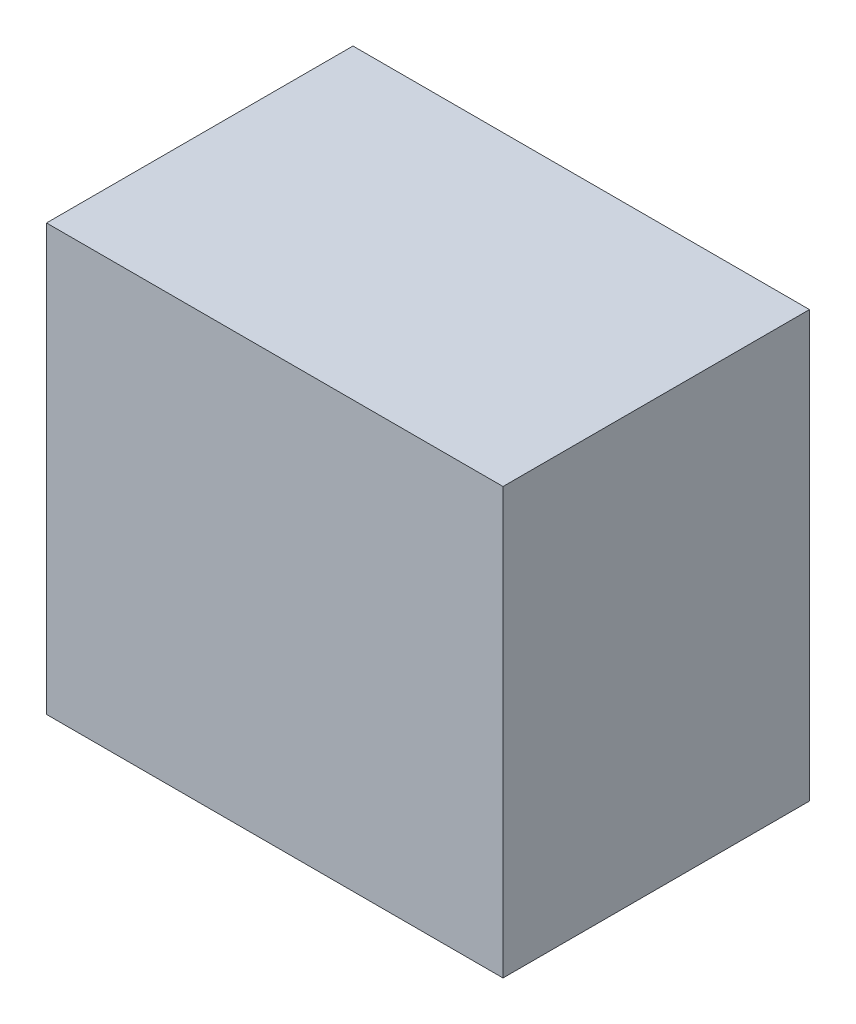
ISO-10303-21;
HEADER;
FILE_DESCRIPTION(('STEP AP214'),'2;1');
FILE_NAME('part.step','',(''),(''),'','','');
FILE_SCHEMA(('AUTOMOTIVE_DESIGN { 1 0 10303 214 1 1 1 1 }'));
ENDSEC;
DATA;
#1=APPLICATION_CONTEXT('core data for automotive mechanical design processes');
#2=APPLICATION_PROTOCOL_DEFINITION('international standard','automotive_design',2000,#1);
#3=PRODUCT_CONTEXT('',#1,'mechanical');
#4=PRODUCT('Part','Part','',(#3));
#5=PRODUCT_RELATED_PRODUCT_CATEGORY('part','',(#4));
#6=PRODUCT_DEFINITION_FORMATION('','',#4);
#7=PRODUCT_DEFINITION_CONTEXT('part definition',#1,'design');
#8=PRODUCT_DEFINITION('design','',#6,#7);
#9=PRODUCT_DEFINITION_SHAPE('','',#8);
#10=(LENGTH_UNIT() NAMED_UNIT(*) SI_UNIT(.MILLI.,.METRE.));
#11=(NAMED_UNIT(*) PLANE_ANGLE_UNIT() SI_UNIT($,.RADIAN.));
#12=(NAMED_UNIT(*) SI_UNIT($,.STERADIAN.) SOLID_ANGLE_UNIT());
#13=UNCERTAINTY_MEASURE_WITH_UNIT(LENGTH_MEASURE(1.E-05),#10,'distance_accuracy_value','');
#14=(GEOMETRIC_REPRESENTATION_CONTEXT(3) GLOBAL_UNCERTAINTY_ASSIGNED_CONTEXT((#13)) GLOBAL_UNIT_ASSIGNED_CONTEXT((#10,
#11,#12)) REPRESENTATION_CONTEXT('',''));
#15=CARTESIAN_POINT('',(0.,0.,0.));
#16=DIRECTION('',(0.,0.,1.));
#17=DIRECTION('',(1.,0.,0.));
#18=AXIS2_PLACEMENT_3D('',#15,#16,#17);
#19=CARTESIAN_POINT('',(-30.1907358786566,22.6807861745121,28.8));
#20=DIRECTION('',(1.,0.,0.));
#21=DIRECTION('',(0.,1.,0.));
#22=AXIS2_PLACEMENT_3D('',#19,#20,#21);
#23=PLANE('',#22);
#24=DIRECTION('',(0.,-1.,0.));
#25=VECTOR('',#24,1.);
#26=CARTESIAN_POINT('',(-30.1907358786566,22.6807861745121,0.));
#27=LINE('',#26,#25);
#28=CARTESIAN_POINT('',(-30.1907358786566,22.6807861745121,0.));
#29=VERTEX_POINT('',#28);
#30=CARTESIAN_POINT('',(-30.1907358786566,-17.3192138254879,0.));
#31=VERTEX_POINT('',#30);
#32=EDGE_CURVE('E102',#29,#31,#27,.T.);
#33=ORIENTED_EDGE('',*,*,#32,.T.);
#34=DIRECTION('',(0.,0.,-1.));
#35=VECTOR('',#34,1.);
#36=CARTESIAN_POINT('',(-30.1907358786566,-17.3192138254879,28.8));
#37=LINE('',#36,#35);
#38=CARTESIAN_POINT('',(-30.1907358786566,-17.3192138254879,28.8));
#39=VERTEX_POINT('',#38);
#40=EDGE_CURVE('E11',#39,#31,#37,.T.);
#41=ORIENTED_EDGE('',*,*,#40,.F.);
#42=DIRECTION('',(0.,-1.,0.));
#43=VECTOR('',#42,1.);
#44=CARTESIAN_POINT('',(-30.1907358786566,22.6807861745121,28.8));
#45=LINE('',#44,#43);
#46=CARTESIAN_POINT('',(-30.1907358786566,22.6807861745121,28.8));
#47=VERTEX_POINT('',#46);
#48=EDGE_CURVE('E90',#47,#39,#45,.T.);
#49=ORIENTED_EDGE('',*,*,#48,.F.);
#50=DIRECTION('',(0.,0.,-1.));
#51=VECTOR('',#50,1.);
#52=CARTESIAN_POINT('',(-30.1907358786566,22.6807861745121,28.8));
#53=LINE('',#52,#51);
#54=EDGE_CURVE('E98',#47,#29,#53,.T.);
#55=ORIENTED_EDGE('',*,*,#54,.T.);
#56=EDGE_LOOP('',(#33,#41,#49,#55));
#57=FACE_BOUND('',#56,.T.);
#58=ADVANCED_FACE('F39',(#57),#23,.F.);
#59=CARTESIAN_POINT('',(-30.1907358786566,-17.3192138254879,28.8));
#60=DIRECTION('',(0.,1.,0.));
#61=DIRECTION('',(0.,0.,1.));
#62=AXIS2_PLACEMENT_3D('',#59,#60,#61);
#63=PLANE('',#62);
#64=DIRECTION('',(1.,0.,0.));
#65=VECTOR('',#64,1.);
#66=CARTESIAN_POINT('',(-30.1907358786566,-17.3192138254879,0.));
#67=LINE('',#66,#65);
#68=CARTESIAN_POINT('',(12.7092641213434,-17.3192138254879,0.));
#69=VERTEX_POINT('',#68);
#70=EDGE_CURVE('E94',#31,#69,#67,.T.);
#71=ORIENTED_EDGE('',*,*,#70,.T.);
#72=DIRECTION('',(0.,0.,-1.));
#73=VECTOR('',#72,1.);
#74=CARTESIAN_POINT('',(12.7092641213434,-17.3192138254879,28.8));
#75=LINE('',#74,#73);
#76=CARTESIAN_POINT('',(12.7092641213434,-17.3192138254879,28.8));
#77=VERTEX_POINT('',#76);
#78=EDGE_CURVE('E47',#77,#69,#75,.T.);
#79=ORIENTED_EDGE('',*,*,#78,.F.);
#80=DIRECTION('',(1.,0.,0.));
#81=VECTOR('',#80,1.);
#82=CARTESIAN_POINT('',(-30.1907358786566,-17.3192138254879,28.8));
#83=LINE('',#82,#81);
#84=EDGE_CURVE('E85',#39,#77,#83,.T.);
#85=ORIENTED_EDGE('',*,*,#84,.F.);
#86=ORIENTED_EDGE('',*,*,#40,.T.);
#87=EDGE_LOOP('',(#71,#79,#85,#86));
#88=FACE_BOUND('',#87,.T.);
#89=ADVANCED_FACE('F93',(#88),#63,.F.);
#90=CARTESIAN_POINT('',(12.7092641213434,22.6807861745121,28.8));
#91=DIRECTION('',(-1.,0.,0.));
#92=DIRECTION('',(0.,-1.,0.));
#93=AXIS2_PLACEMENT_3D('',#90,#91,#92);
#94=PLANE('',#93);
#95=DIRECTION('',(0.,1.,0.));
#96=VECTOR('',#95,1.);
#97=CARTESIAN_POINT('',(12.7092641213434,22.6807861745121,0.));
#98=LINE('',#97,#96);
#99=CARTESIAN_POINT('',(12.7092641213434,22.6807861745121,0.));
#100=VERTEX_POINT('',#99);
#101=EDGE_CURVE('E72',#69,#100,#98,.T.);
#102=ORIENTED_EDGE('',*,*,#101,.T.);
#103=DIRECTION('',(0.,0.,-1.));
#104=VECTOR('',#103,1.);
#105=CARTESIAN_POINT('',(12.7092641213434,22.6807861745121,28.8));
#106=LINE('',#105,#104);
#107=CARTESIAN_POINT('',(12.7092641213434,22.6807861745121,28.8));
#108=VERTEX_POINT('',#107);
#109=EDGE_CURVE('E95',#108,#100,#106,.T.);
#110=ORIENTED_EDGE('',*,*,#109,.F.);
#111=DIRECTION('',(0.,1.,0.));
#112=VECTOR('',#111,1.);
#113=CARTESIAN_POINT('',(12.7092641213434,22.6807861745121,28.8));
#114=LINE('',#113,#112);
#115=EDGE_CURVE('E88',#77,#108,#114,.T.);
#116=ORIENTED_EDGE('',*,*,#115,.F.);
#117=ORIENTED_EDGE('',*,*,#78,.T.);
#118=EDGE_LOOP('',(#102,#110,#116,#117));
#119=FACE_BOUND('',#118,.T.);
#120=ADVANCED_FACE('F96',(#119),#94,.F.);
#121=CARTESIAN_POINT('',(-30.1907358786566,22.6807861745121,28.8));
#122=DIRECTION('',(0.,-1.,0.));
#123=DIRECTION('',(0.,0.,-1.));
#124=AXIS2_PLACEMENT_3D('',#121,#122,#123);
#125=PLANE('',#124);
#126=DIRECTION('',(-1.,0.,0.));
#127=VECTOR('',#126,1.);
#128=CARTESIAN_POINT('',(-30.1907358786566,22.6807861745121,0.));
#129=LINE('',#128,#127);
#130=EDGE_CURVE('E78',#100,#29,#129,.T.);
#131=ORIENTED_EDGE('',*,*,#130,.T.);
#132=ORIENTED_EDGE('',*,*,#54,.F.);
#133=DIRECTION('',(-1.,0.,0.));
#134=VECTOR('',#133,1.);
#135=CARTESIAN_POINT('',(-30.1907358786566,22.6807861745121,28.8));
#136=LINE('',#135,#134);
#137=EDGE_CURVE('E55',#108,#47,#136,.T.);
#138=ORIENTED_EDGE('',*,*,#137,.F.);
#139=ORIENTED_EDGE('',*,*,#109,.T.);
#140=EDGE_LOOP('',(#131,#132,#138,#139));
#141=FACE_BOUND('',#140,.T.);
#142=ADVANCED_FACE('F109',(#141),#125,.F.);
#143=CARTESIAN_POINT('',(0.,0.,28.8));
#144=DIRECTION('',(0.,0.,1.));
#145=DIRECTION('',(1.,0.,0.));
#146=AXIS2_PLACEMENT_3D('',#143,#144,#145);
#147=PLANE('',#146);
#148=ORIENTED_EDGE('',*,*,#48,.T.);
#149=ORIENTED_EDGE('',*,*,#84,.T.);
#150=ORIENTED_EDGE('',*,*,#115,.T.);
#151=ORIENTED_EDGE('',*,*,#137,.T.);
#152=EDGE_LOOP('',(#148,#149,#150,#151));
#153=FACE_BOUND('',#152,.T.);
#154=ADVANCED_FACE('F86',(#153),#147,.T.);
#155=CARTESIAN_POINT('',(0.,0.,0.));
#156=DIRECTION('',(0.,0.,1.));
#157=DIRECTION('',(1.,0.,0.));
#158=AXIS2_PLACEMENT_3D('',#155,#156,#157);
#159=PLANE('',#158);
#160=ORIENTED_EDGE('',*,*,#32,.F.);
#161=ORIENTED_EDGE('',*,*,#130,.F.);
#162=ORIENTED_EDGE('',*,*,#101,.F.);
#163=ORIENTED_EDGE('',*,*,#70,.F.);
#164=EDGE_LOOP('',(#160,#161,#162,#163));
#165=FACE_BOUND('',#164,.T.);
#166=ADVANCED_FACE('F112',(#165),#159,.F.);
#167=CLOSED_SHELL('',(#58,#89,#120,#142,#154,#166));
#168=MANIFOLD_SOLID_BREP('B2',#167);
#169=ADVANCED_BREP_SHAPE_REPRESENTATION('',(#18,#168),#14);
#170=SHAPE_DEFINITION_REPRESENTATION(#9,#169);
ENDSEC;
END-ISO-10303-21;
